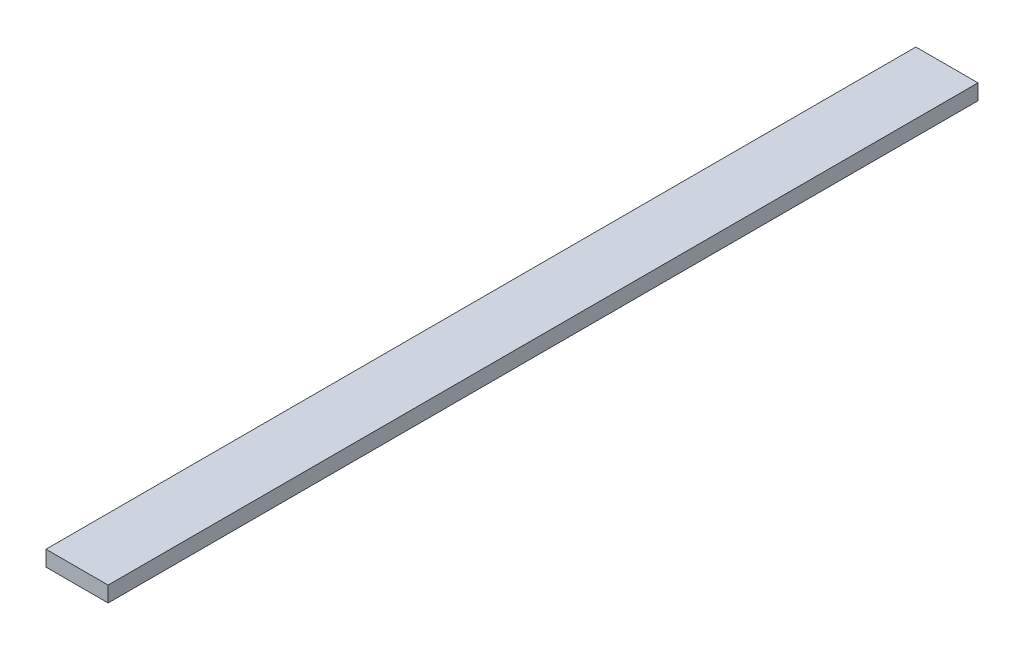
ISO-10303-21;
HEADER;
FILE_DESCRIPTION(('STEP AP214'),'2;1');
FILE_NAME('part.step','',(''),(''),'','','');
FILE_SCHEMA(('AUTOMOTIVE_DESIGN { 1 0 10303 214 1 1 1 1 }'));
ENDSEC;
DATA;
#1=APPLICATION_CONTEXT('core data for automotive mechanical design processes');
#2=APPLICATION_PROTOCOL_DEFINITION('international standard','automotive_design',2000,#1);
#3=PRODUCT_CONTEXT('',#1,'mechanical');
#4=PRODUCT('Part','Part','',(#3));
#5=PRODUCT_RELATED_PRODUCT_CATEGORY('part','',(#4));
#6=PRODUCT_DEFINITION_FORMATION('','',#4);
#7=PRODUCT_DEFINITION_CONTEXT('part definition',#1,'design');
#8=PRODUCT_DEFINITION('design','',#6,#7);
#9=PRODUCT_DEFINITION_SHAPE('','',#8);
#10=(LENGTH_UNIT() NAMED_UNIT(*) SI_UNIT(.MILLI.,.METRE.));
#11=(NAMED_UNIT(*) PLANE_ANGLE_UNIT() SI_UNIT($,.RADIAN.));
#12=(NAMED_UNIT(*) SI_UNIT($,.STERADIAN.) SOLID_ANGLE_UNIT());
#13=UNCERTAINTY_MEASURE_WITH_UNIT(LENGTH_MEASURE(1.E-05),#10,'distance_accuracy_value','');
#14=(GEOMETRIC_REPRESENTATION_CONTEXT(3) GLOBAL_UNCERTAINTY_ASSIGNED_CONTEXT((#13)) GLOBAL_UNIT_ASSIGNED_CONTEXT((#10,
#11,#12)) REPRESENTATION_CONTEXT('',''));
#15=CARTESIAN_POINT('',(0.,0.,0.));
#16=DIRECTION('',(0.,0.,1.));
#17=DIRECTION('',(1.,0.,0.));
#18=AXIS2_PLACEMENT_3D('',#15,#16,#17);
#19=CARTESIAN_POINT('',(0.,6.35,0.));
#20=DIRECTION('',(1.,0.,0.));
#21=DIRECTION('',(0.,0.,-1.));
#22=AXIS2_PLACEMENT_3D('',#19,#20,#21);
#23=PLANE('',#22);
#24=DIRECTION('',(0.,0.,1.));
#25=VECTOR('',#24,1.);
#26=CARTESIAN_POINT('',(0.,0.,0.));
#27=LINE('',#26,#25);
#28=CARTESIAN_POINT('',(0.,0.,-355.6));
#29=VERTEX_POINT('',#28);
#30=CARTESIAN_POINT('',(0.,0.,0.));
#31=VERTEX_POINT('',#30);
#32=EDGE_CURVE('E80',#29,#31,#27,.T.);
#33=ORIENTED_EDGE('',*,*,#32,.T.);
#34=DIRECTION('',(0.,-1.,0.));
#35=VECTOR('',#34,1.);
#36=CARTESIAN_POINT('',(0.,6.35,0.));
#37=LINE('',#36,#35);
#38=CARTESIAN_POINT('',(0.,6.35,0.));
#39=VERTEX_POINT('',#38);
#40=EDGE_CURVE('E11',#39,#31,#37,.T.);
#41=ORIENTED_EDGE('',*,*,#40,.F.);
#42=DIRECTION('',(0.,0.,1.));
#43=VECTOR('',#42,1.);
#44=CARTESIAN_POINT('',(0.,6.35,0.));
#45=LINE('',#44,#43);
#46=CARTESIAN_POINT('',(0.,6.35,-355.6));
#47=VERTEX_POINT('',#46);
#48=EDGE_CURVE('E68',#47,#39,#45,.T.);
#49=ORIENTED_EDGE('',*,*,#48,.F.);
#50=DIRECTION('',(0.,-1.,0.));
#51=VECTOR('',#50,1.);
#52=CARTESIAN_POINT('',(0.,6.35,-355.6));
#53=LINE('',#52,#51);
#54=EDGE_CURVE('E76',#47,#29,#53,.T.);
#55=ORIENTED_EDGE('',*,*,#54,.T.);
#56=EDGE_LOOP('',(#33,#41,#49,#55));
#57=FACE_BOUND('',#56,.T.);
#58=ADVANCED_FACE('F17',(#57),#23,.F.);
#59=CARTESIAN_POINT('',(0.,6.35,0.));
#60=DIRECTION('',(0.,0.,-1.));
#61=DIRECTION('',(-1.,0.,0.));
#62=AXIS2_PLACEMENT_3D('',#59,#60,#61);
#63=PLANE('',#62);
#64=DIRECTION('',(1.,0.,0.));
#65=VECTOR('',#64,1.);
#66=CARTESIAN_POINT('',(0.,0.,0.));
#67=LINE('',#66,#65);
#68=CARTESIAN_POINT('',(25.4,0.,0.));
#69=VERTEX_POINT('',#68);
#70=EDGE_CURVE('E72',#31,#69,#67,.T.);
#71=ORIENTED_EDGE('',*,*,#70,.T.);
#72=DIRECTION('',(0.,-1.,0.));
#73=VECTOR('',#72,1.);
#74=CARTESIAN_POINT('',(25.4,6.35,0.));
#75=LINE('',#74,#73);
#76=CARTESIAN_POINT('',(25.4,6.35,0.));
#77=VERTEX_POINT('',#76);
#78=EDGE_CURVE('E25',#77,#69,#75,.T.);
#79=ORIENTED_EDGE('',*,*,#78,.F.);
#80=DIRECTION('',(1.,0.,0.));
#81=VECTOR('',#80,1.);
#82=CARTESIAN_POINT('',(0.,6.35,0.));
#83=LINE('',#82,#81);
#84=EDGE_CURVE('E63',#39,#77,#83,.T.);
#85=ORIENTED_EDGE('',*,*,#84,.F.);
#86=ORIENTED_EDGE('',*,*,#40,.T.);
#87=EDGE_LOOP('',(#71,#79,#85,#86));
#88=FACE_BOUND('',#87,.T.);
#89=ADVANCED_FACE('F71',(#88),#63,.F.);
#90=CARTESIAN_POINT('',(25.4,6.35,0.));
#91=DIRECTION('',(-1.,0.,0.));
#92=DIRECTION('',(0.,0.,1.));
#93=AXIS2_PLACEMENT_3D('',#90,#91,#92);
#94=PLANE('',#93);
#95=DIRECTION('',(0.,0.,-1.));
#96=VECTOR('',#95,1.);
#97=CARTESIAN_POINT('',(25.4,0.,0.));
#98=LINE('',#97,#96);
#99=CARTESIAN_POINT('',(25.4,0.,-355.6));
#100=VERTEX_POINT('',#99);
#101=EDGE_CURVE('E50',#69,#100,#98,.T.);
#102=ORIENTED_EDGE('',*,*,#101,.T.);
#103=DIRECTION('',(0.,-1.,0.));
#104=VECTOR('',#103,1.);
#105=CARTESIAN_POINT('',(25.4,6.35,-355.6));
#106=LINE('',#105,#104);
#107=CARTESIAN_POINT('',(25.4,6.35,-355.6));
#108=VERTEX_POINT('',#107);
#109=EDGE_CURVE('E73',#108,#100,#106,.T.);
#110=ORIENTED_EDGE('',*,*,#109,.F.);
#111=DIRECTION('',(0.,0.,-1.));
#112=VECTOR('',#111,1.);
#113=CARTESIAN_POINT('',(25.4,6.35,0.));
#114=LINE('',#113,#112);
#115=EDGE_CURVE('E66',#77,#108,#114,.T.);
#116=ORIENTED_EDGE('',*,*,#115,.F.);
#117=ORIENTED_EDGE('',*,*,#78,.T.);
#118=EDGE_LOOP('',(#102,#110,#116,#117));
#119=FACE_BOUND('',#118,.T.);
#120=ADVANCED_FACE('F74',(#119),#94,.F.);
#121=CARTESIAN_POINT('',(0.,6.35,-355.6));
#122=DIRECTION('',(0.,0.,1.));
#123=DIRECTION('',(1.,0.,0.));
#124=AXIS2_PLACEMENT_3D('',#121,#122,#123);
#125=PLANE('',#124);
#126=DIRECTION('',(-1.,0.,0.));
#127=VECTOR('',#126,1.);
#128=CARTESIAN_POINT('',(0.,0.,-355.6));
#129=LINE('',#128,#127);
#130=EDGE_CURVE('E56',#100,#29,#129,.T.);
#131=ORIENTED_EDGE('',*,*,#130,.T.);
#132=ORIENTED_EDGE('',*,*,#54,.F.);
#133=DIRECTION('',(-1.,0.,0.));
#134=VECTOR('',#133,1.);
#135=CARTESIAN_POINT('',(0.,6.35,-355.6));
#136=LINE('',#135,#134);
#137=EDGE_CURVE('E33',#108,#47,#136,.T.);
#138=ORIENTED_EDGE('',*,*,#137,.F.);
#139=ORIENTED_EDGE('',*,*,#109,.T.);
#140=EDGE_LOOP('',(#131,#132,#138,#139));
#141=FACE_BOUND('',#140,.T.);
#142=ADVANCED_FACE('F87',(#141),#125,.F.);
#143=CARTESIAN_POINT('',(0.,6.35,-355.6));
#144=DIRECTION('',(0.,-1.,0.));
#145=DIRECTION('',(0.,0.,-1.));
#146=AXIS2_PLACEMENT_3D('',#143,#144,#145);
#147=PLANE('',#146);
#148=ORIENTED_EDGE('',*,*,#48,.T.);
#149=ORIENTED_EDGE('',*,*,#84,.T.);
#150=ORIENTED_EDGE('',*,*,#115,.T.);
#151=ORIENTED_EDGE('',*,*,#137,.T.);
#152=EDGE_LOOP('',(#148,#149,#150,#151));
#153=FACE_BOUND('',#152,.T.);
#154=ADVANCED_FACE('F64',(#153),#147,.F.);
#155=CARTESIAN_POINT('',(0.,0.,-355.6));
#156=DIRECTION('',(0.,-1.,0.));
#157=DIRECTION('',(0.,0.,-1.));
#158=AXIS2_PLACEMENT_3D('',#155,#156,#157);
#159=PLANE('',#158);
#160=ORIENTED_EDGE('',*,*,#32,.F.);
#161=ORIENTED_EDGE('',*,*,#130,.F.);
#162=ORIENTED_EDGE('',*,*,#101,.F.);
#163=ORIENTED_EDGE('',*,*,#70,.F.);
#164=EDGE_LOOP('',(#160,#161,#162,#163));
#165=FACE_BOUND('',#164,.T.);
#166=ADVANCED_FACE('F90',(#165),#159,.T.);
#167=CLOSED_SHELL('',(#58,#89,#120,#142,#154,#166));
#168=MANIFOLD_SOLID_BREP('B1',#167);
#169=ADVANCED_BREP_SHAPE_REPRESENTATION('',(#18,#168),#14);
#170=SHAPE_DEFINITION_REPRESENTATION(#9,#169);
ENDSEC;
END-ISO-10303-21;
